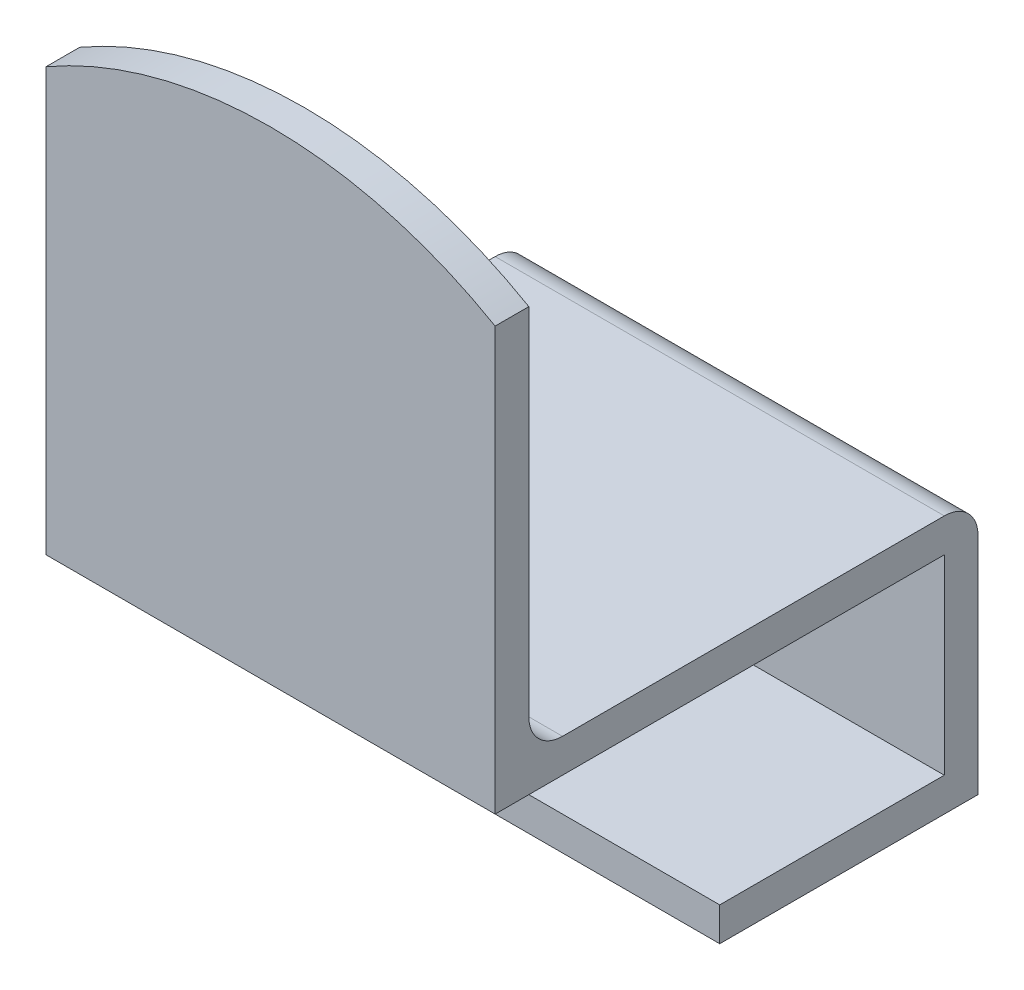
ISO-10303-21;
HEADER;
FILE_DESCRIPTION(('STEP AP214'),'2;1');
FILE_NAME('part.step','',(''),(''),'','','');
FILE_SCHEMA(('AUTOMOTIVE_DESIGN { 1 0 10303 214 1 1 1 1 }'));
ENDSEC;
DATA;
#1=APPLICATION_CONTEXT('core data for automotive mechanical design processes');
#2=APPLICATION_PROTOCOL_DEFINITION('international standard','automotive_design',2000,#1);
#3=PRODUCT_CONTEXT('',#1,'mechanical');
#4=PRODUCT('Part','Part','',(#3));
#5=PRODUCT_RELATED_PRODUCT_CATEGORY('part','',(#4));
#6=PRODUCT_DEFINITION_FORMATION('','',#4);
#7=PRODUCT_DEFINITION_CONTEXT('part definition',#1,'design');
#8=PRODUCT_DEFINITION('design','',#6,#7);
#9=PRODUCT_DEFINITION_SHAPE('','',#8);
#10=(LENGTH_UNIT() NAMED_UNIT(*) SI_UNIT(.MILLI.,.METRE.));
#11=(NAMED_UNIT(*) PLANE_ANGLE_UNIT() SI_UNIT($,.RADIAN.));
#12=(NAMED_UNIT(*) SI_UNIT($,.STERADIAN.) SOLID_ANGLE_UNIT());
#13=UNCERTAINTY_MEASURE_WITH_UNIT(LENGTH_MEASURE(1.E-05),#10,'distance_accuracy_value','');
#14=(GEOMETRIC_REPRESENTATION_CONTEXT(3) GLOBAL_UNCERTAINTY_ASSIGNED_CONTEXT((#13)) GLOBAL_UNIT_ASSIGNED_CONTEXT((#10,
#11,#12)) REPRESENTATION_CONTEXT('',''));
#15=CARTESIAN_POINT('',(0.,0.,0.));
#16=DIRECTION('',(0.,0.,1.));
#17=DIRECTION('',(1.,0.,0.));
#18=AXIS2_PLACEMENT_3D('',#15,#16,#17);
#19=CARTESIAN_POINT('',(-20.,-20.,-17.));
#20=DIRECTION('',(0.,0.,-1.));
#21=DIRECTION('',(-1.,0.,0.));
#22=AXIS2_PLACEMENT_3D('',#19,#20,#21);
#23=PLANE('',#22);
#24=DIRECTION('',(-1.,0.,0.));
#25=VECTOR('',#24,1.);
#26=CARTESIAN_POINT('',(-20.,-17.,-17.));
#27=LINE('',#26,#25);
#28=CARTESIAN_POINT('',(20.,-17.,-17.));
#29=VERTEX_POINT('',#28);
#30=CARTESIAN_POINT('',(-20.,-17.,-17.));
#31=VERTEX_POINT('',#30);
#32=EDGE_CURVE('E143',#29,#31,#27,.T.);
#33=ORIENTED_EDGE('',*,*,#32,.F.);
#34=DIRECTION('',(0.,1.,0.));
#35=VECTOR('',#34,1.);
#36=CARTESIAN_POINT('',(20.,-20.,-17.));
#37=LINE('',#36,#35);
#38=CARTESIAN_POINT('',(20.,0.,-17.));
#39=VERTEX_POINT('',#38);
#40=EDGE_CURVE('E149',#29,#39,#37,.T.);
#41=ORIENTED_EDGE('',*,*,#40,.T.);
#42=DIRECTION('',(-1.,0.,0.));
#43=VECTOR('',#42,1.);
#44=CARTESIAN_POINT('',(-20.,0.,-17.));
#45=LINE('',#44,#43);
#46=CARTESIAN_POINT('',(-20.,0.,-17.));
#47=VERTEX_POINT('',#46);
#48=EDGE_CURVE('E162',#39,#47,#45,.T.);
#49=ORIENTED_EDGE('',*,*,#48,.T.);
#50=DIRECTION('',(0.,1.,0.));
#51=VECTOR('',#50,1.);
#52=CARTESIAN_POINT('',(-20.,-20.,-17.));
#53=LINE('',#52,#51);
#54=EDGE_CURVE('E172',#31,#47,#53,.T.);
#55=ORIENTED_EDGE('',*,*,#54,.F.);
#56=EDGE_LOOP('',(#33,#41,#49,#55));
#57=FACE_BOUND('',#56,.T.);
#58=ADVANCED_FACE('F33',(#57),#23,.F.);
#59=CARTESIAN_POINT('',(-20.,3.,20.));
#60=DIRECTION('',(-1.,0.,0.));
#61=DIRECTION('',(0.,0.,1.));
#62=AXIS2_PLACEMENT_3D('',#59,#60,#61);
#63=PLANE('',#62);
#64=DIRECTION('',(0.,0.,-1.));
#65=VECTOR('',#64,1.);
#66=CARTESIAN_POINT('',(-20.,3.,20.));
#67=LINE('',#66,#65);
#68=CARTESIAN_POINT('',(-20.,3.,17.));
#69=VERTEX_POINT('',#68);
#70=CARTESIAN_POINT('',(-20.,3.,-17.));
#71=VERTEX_POINT('',#70);
#72=EDGE_CURVE('E191',#69,#71,#67,.T.);
#73=ORIENTED_EDGE('',*,*,#72,.T.);
#74=CARTESIAN_POINT('',(-20.,0.,-17.));
#75=DIRECTION('',(-1.,0.,0.));
#76=DIRECTION('',(0.,0.,1.));
#77=AXIS2_PLACEMENT_3D('',#74,#75,#76);
#78=CIRCLE('',#77,3.);
#79=CARTESIAN_POINT('',(-20.,0.,-20.));
#80=VERTEX_POINT('',#79);
#81=EDGE_CURVE('E48',#71,#80,#78,.T.);
#82=ORIENTED_EDGE('',*,*,#81,.T.);
#83=DIRECTION('',(0.,-1.,0.));
#84=VECTOR('',#83,1.);
#85=CARTESIAN_POINT('',(-20.,3.,-20.));
#86=LINE('',#85,#84);
#87=CARTESIAN_POINT('',(-20.,-20.,-20.));
#88=VERTEX_POINT('',#87);
#89=EDGE_CURVE('E197',#80,#88,#86,.T.);
#90=ORIENTED_EDGE('',*,*,#89,.T.);
#91=DIRECTION('',(0.,0.,-1.));
#92=VECTOR('',#91,1.);
#93=CARTESIAN_POINT('',(-20.,-20.,-20.));
#94=LINE('',#93,#92);
#95=CARTESIAN_POINT('',(-20.,-20.,3.));
#96=VERTEX_POINT('',#95);
#97=EDGE_CURVE('E164',#96,#88,#94,.T.);
#98=ORIENTED_EDGE('',*,*,#97,.F.);
#99=DIRECTION('',(0.,-1.,0.));
#100=VECTOR('',#99,1.);
#101=CARTESIAN_POINT('',(-20.,-20.,3.));
#102=LINE('',#101,#100);
#103=CARTESIAN_POINT('',(-20.,-17.,3.));
#104=VERTEX_POINT('',#103);
#105=EDGE_CURVE('E133',#104,#96,#102,.T.);
#106=ORIENTED_EDGE('',*,*,#105,.F.);
#107=DIRECTION('',(0.,0.,-1.));
#108=VECTOR('',#107,1.);
#109=CARTESIAN_POINT('',(-20.,-17.,3.));
#110=LINE('',#109,#108);
#111=EDGE_CURVE('E129',#104,#31,#110,.T.);
#112=ORIENTED_EDGE('',*,*,#111,.T.);
#113=ORIENTED_EDGE('',*,*,#54,.T.);
#114=DIRECTION('',(0.,0.,-1.));
#115=VECTOR('',#114,1.);
#116=CARTESIAN_POINT('',(-20.,0.,20.));
#117=LINE('',#116,#115);
#118=CARTESIAN_POINT('',(-20.,0.,23.));
#119=VERTEX_POINT('',#118);
#120=EDGE_CURVE('E190',#119,#47,#117,.T.);
#121=ORIENTED_EDGE('',*,*,#120,.F.);
#122=DIRECTION('',(0.,-1.,0.));
#123=VECTOR('',#122,1.);
#124=CARTESIAN_POINT('',(-20.,53.,23.));
#125=LINE('',#124,#123);
#126=CARTESIAN_POINT('',(-20.,37.6410161513776,23.));
#127=VERTEX_POINT('',#126);
#128=EDGE_CURVE('E182',#127,#119,#125,.T.);
#129=ORIENTED_EDGE('',*,*,#128,.F.);
#130=DIRECTION('',(0.,0.,-1.));
#131=VECTOR('',#130,1.);
#132=CARTESIAN_POINT('',(-20.,37.6410161513775,23.001));
#133=LINE('',#132,#131);
#134=CARTESIAN_POINT('',(-20.,37.6410161513775,20.));
#135=VERTEX_POINT('',#134);
#136=EDGE_CURVE('E159',#127,#135,#133,.T.);
#137=ORIENTED_EDGE('',*,*,#136,.T.);
#138=DIRECTION('',(0.,-1.,0.));
#139=VECTOR('',#138,1.);
#140=CARTESIAN_POINT('',(-20.,53.,20.));
#141=LINE('',#140,#139);
#142=CARTESIAN_POINT('',(-20.,6.,20.));
#143=VERTEX_POINT('',#142);
#144=EDGE_CURVE('E184',#135,#143,#141,.T.);
#145=ORIENTED_EDGE('',*,*,#144,.T.);
#146=CARTESIAN_POINT('',(-20.,6.,17.));
#147=DIRECTION('',(-1.,0.,0.));
#148=DIRECTION('',(0.,0.,1.));
#149=AXIS2_PLACEMENT_3D('',#146,#147,#148);
#150=CIRCLE('',#149,3.);
#151=EDGE_CURVE('E11',#143,#69,#150,.F.);
#152=ORIENTED_EDGE('',*,*,#151,.T.);
#153=EDGE_LOOP('',(#73,#82,#90,#98,#106,#112,#113,#121,#129,#137,#145,#152));
#154=FACE_BOUND('',#153,.T.);
#155=ADVANCED_FACE('F227',(#154),#63,.T.);
#156=CARTESIAN_POINT('',(20.,3.,20.));
#157=DIRECTION('',(-1.,0.,0.));
#158=DIRECTION('',(0.,0.,1.));
#159=AXIS2_PLACEMENT_3D('',#156,#157,#158);
#160=PLANE('',#159);
#161=DIRECTION('',(0.,-1.,0.));
#162=VECTOR('',#161,1.);
#163=CARTESIAN_POINT('',(20.,3.,-20.));
#164=LINE('',#163,#162);
#165=CARTESIAN_POINT('',(20.,0.,-20.));
#166=VERTEX_POINT('',#165);
#167=CARTESIAN_POINT('',(20.,-20.,-20.));
#168=VERTEX_POINT('',#167);
#169=EDGE_CURVE('E201',#166,#168,#164,.T.);
#170=ORIENTED_EDGE('',*,*,#169,.F.);
#171=CARTESIAN_POINT('',(20.,0.,-17.));
#172=DIRECTION('',(-1.,0.,0.));
#173=DIRECTION('',(0.,0.,1.));
#174=AXIS2_PLACEMENT_3D('',#171,#172,#173);
#175=CIRCLE('',#174,3.);
#176=CARTESIAN_POINT('',(20.,3.,-17.));
#177=VERTEX_POINT('',#176);
#178=EDGE_CURVE('E56',#166,#177,#175,.F.);
#179=ORIENTED_EDGE('',*,*,#178,.T.);
#180=DIRECTION('',(0.,0.,-1.));
#181=VECTOR('',#180,1.);
#182=CARTESIAN_POINT('',(20.,3.,20.));
#183=LINE('',#182,#181);
#184=CARTESIAN_POINT('',(20.,3.,17.));
#185=VERTEX_POINT('',#184);
#186=EDGE_CURVE('E193',#185,#177,#183,.T.);
#187=ORIENTED_EDGE('',*,*,#186,.F.);
#188=CARTESIAN_POINT('',(20.,6.,17.));
#189=DIRECTION('',(-1.,0.,0.));
#190=DIRECTION('',(0.,0.,1.));
#191=AXIS2_PLACEMENT_3D('',#188,#189,#190);
#192=CIRCLE('',#191,3.);
#193=CARTESIAN_POINT('',(20.,6.,20.));
#194=VERTEX_POINT('',#193);
#195=EDGE_CURVE('E41',#185,#194,#192,.T.);
#196=ORIENTED_EDGE('',*,*,#195,.T.);
#197=DIRECTION('',(0.,-1.,0.));
#198=VECTOR('',#197,1.);
#199=CARTESIAN_POINT('',(20.,53.,20.));
#200=LINE('',#199,#198);
#201=CARTESIAN_POINT('',(20.,37.6410161513775,20.));
#202=VERTEX_POINT('',#201);
#203=EDGE_CURVE('E187',#202,#194,#200,.T.);
#204=ORIENTED_EDGE('',*,*,#203,.F.);
#205=DIRECTION('',(0.,0.,-1.));
#206=VECTOR('',#205,1.);
#207=CARTESIAN_POINT('',(20.,37.6410161513775,23.001));
#208=LINE('',#207,#206);
#209=CARTESIAN_POINT('',(20.,37.6410161513775,23.));
#210=VERTEX_POINT('',#209);
#211=EDGE_CURVE('E158',#210,#202,#208,.T.);
#212=ORIENTED_EDGE('',*,*,#211,.F.);
#213=DIRECTION('',(0.,-1.,0.));
#214=VECTOR('',#213,1.);
#215=CARTESIAN_POINT('',(20.,53.,23.));
#216=LINE('',#215,#214);
#217=CARTESIAN_POINT('',(20.,0.,23.));
#218=VERTEX_POINT('',#217);
#219=EDGE_CURVE('E180',#210,#218,#216,.T.);
#220=ORIENTED_EDGE('',*,*,#219,.T.);
#221=DIRECTION('',(0.,0.,-1.));
#222=VECTOR('',#221,1.);
#223=CARTESIAN_POINT('',(20.,0.,20.));
#224=LINE('',#223,#222);
#225=EDGE_CURVE('E194',#218,#39,#224,.T.);
#226=ORIENTED_EDGE('',*,*,#225,.T.);
#227=ORIENTED_EDGE('',*,*,#40,.F.);
#228=DIRECTION('',(0.,0.,-1.));
#229=VECTOR('',#228,1.);
#230=CARTESIAN_POINT('',(20.,-17.,3.));
#231=LINE('',#230,#229);
#232=CARTESIAN_POINT('',(20.,-17.,3.));
#233=VERTEX_POINT('',#232);
#234=EDGE_CURVE('E126',#233,#29,#231,.T.);
#235=ORIENTED_EDGE('',*,*,#234,.F.);
#236=DIRECTION('',(0.,1.,0.));
#237=VECTOR('',#236,1.);
#238=CARTESIAN_POINT('',(20.,-17.,3.));
#239=LINE('',#238,#237);
#240=CARTESIAN_POINT('',(20.,-20.,3.));
#241=VERTEX_POINT('',#240);
#242=EDGE_CURVE('E134',#241,#233,#239,.T.);
#243=ORIENTED_EDGE('',*,*,#242,.F.);
#244=DIRECTION('',(0.,0.,1.));
#245=VECTOR('',#244,1.);
#246=CARTESIAN_POINT('',(20.,-20.,-20.));
#247=LINE('',#246,#245);
#248=EDGE_CURVE('E170',#168,#241,#247,.T.);
#249=ORIENTED_EDGE('',*,*,#248,.F.);
#250=EDGE_LOOP('',(#170,#179,#187,#196,#204,#212,#220,#226,#227,#235,#243,#249));
#251=FACE_BOUND('',#250,.T.);
#252=ADVANCED_FACE('F147',(#251),#160,.F.);
#253=CARTESIAN_POINT('',(-20.,3.,-20.));
#254=DIRECTION('',(0.,0.,-1.));
#255=DIRECTION('',(-1.,0.,0.));
#256=AXIS2_PLACEMENT_3D('',#253,#254,#255);
#257=PLANE('',#256);
#258=ORIENTED_EDGE('',*,*,#89,.F.);
#259=DIRECTION('',(1.,0.,0.));
#260=VECTOR('',#259,1.);
#261=CARTESIAN_POINT('',(20.,0.,-20.));
#262=LINE('',#261,#260);
#263=EDGE_CURVE('E211',#80,#166,#262,.T.);
#264=ORIENTED_EDGE('',*,*,#263,.T.);
#265=ORIENTED_EDGE('',*,*,#169,.T.);
#266=DIRECTION('',(1.,0.,0.));
#267=VECTOR('',#266,1.);
#268=CARTESIAN_POINT('',(-20.,-20.,-20.));
#269=LINE('',#268,#267);
#270=EDGE_CURVE('E167',#88,#168,#269,.T.);
#271=ORIENTED_EDGE('',*,*,#270,.F.);
#272=EDGE_LOOP('',(#258,#264,#265,#271));
#273=FACE_BOUND('',#272,.T.);
#274=ADVANCED_FACE('F231',(#273),#257,.T.);
#275=CARTESIAN_POINT('',(0.,3.,0.));
#276=DIRECTION('',(0.,-1.,0.));
#277=DIRECTION('',(0.,0.,-1.));
#278=AXIS2_PLACEMENT_3D('',#275,#276,#277);
#279=PLANE('',#278);
#280=ORIENTED_EDGE('',*,*,#72,.F.);
#281=DIRECTION('',(1.,0.,0.));
#282=VECTOR('',#281,1.);
#283=CARTESIAN_POINT('',(20.,3.,17.));
#284=LINE('',#283,#282);
#285=EDGE_CURVE('E206',#69,#185,#284,.T.);
#286=ORIENTED_EDGE('',*,*,#285,.T.);
#287=ORIENTED_EDGE('',*,*,#186,.T.);
#288=DIRECTION('',(1.,0.,0.));
#289=VECTOR('',#288,1.);
#290=CARTESIAN_POINT('',(-20.,3.,-17.));
#291=LINE('',#290,#289);
#292=EDGE_CURVE('E203',#177,#71,#291,.F.);
#293=ORIENTED_EDGE('',*,*,#292,.T.);
#294=EDGE_LOOP('',(#280,#286,#287,#293));
#295=FACE_BOUND('',#294,.T.);
#296=ADVANCED_FACE('F229',(#295),#279,.F.);
#297=CARTESIAN_POINT('',(0.,0.,0.));
#298=DIRECTION('',(0.,-1.,0.));
#299=DIRECTION('',(0.,0.,-1.));
#300=AXIS2_PLACEMENT_3D('',#297,#298,#299);
#301=PLANE('',#300);
#302=ORIENTED_EDGE('',*,*,#48,.F.);
#303=ORIENTED_EDGE('',*,*,#225,.F.);
#304=DIRECTION('',(1.,0.,0.));
#305=VECTOR('',#304,1.);
#306=CARTESIAN_POINT('',(20.,0.,23.));
#307=LINE('',#306,#305);
#308=EDGE_CURVE('E177',#119,#218,#307,.T.);
#309=ORIENTED_EDGE('',*,*,#308,.F.);
#310=ORIENTED_EDGE('',*,*,#120,.T.);
#311=EDGE_LOOP('',(#302,#303,#309,#310));
#312=FACE_BOUND('',#311,.T.);
#313=ADVANCED_FACE('F243',(#312),#301,.T.);
#314=CARTESIAN_POINT('',(20.,53.,20.));
#315=DIRECTION('',(0.,0.,1.));
#316=DIRECTION('',(1.,0.,0.));
#317=AXIS2_PLACEMENT_3D('',#314,#315,#316);
#318=PLANE('',#317);
#319=ORIENTED_EDGE('',*,*,#203,.T.);
#320=DIRECTION('',(1.,0.,0.));
#321=VECTOR('',#320,1.);
#322=CARTESIAN_POINT('',(-20.,6.,20.));
#323=LINE('',#322,#321);
#324=EDGE_CURVE('E209',#194,#143,#323,.F.);
#325=ORIENTED_EDGE('',*,*,#324,.T.);
#326=ORIENTED_EDGE('',*,*,#144,.F.);
#327=CARTESIAN_POINT('',(0.,3.,20.));
#328=DIRECTION('',(0.,0.,1.));
#329=DIRECTION('',(-1.,0.,0.));
#330=AXIS2_PLACEMENT_3D('',#327,#328,#329);
#331=CIRCLE('',#330,40.);
#332=EDGE_CURVE('E152',#202,#135,#331,.T.);
#333=ORIENTED_EDGE('',*,*,#332,.F.);
#334=EDGE_LOOP('',(#319,#325,#326,#333));
#335=FACE_BOUND('',#334,.T.);
#336=ADVANCED_FACE('F222',(#335),#318,.F.);
#337=CARTESIAN_POINT('',(20.,53.,23.));
#338=DIRECTION('',(0.,0.,-1.));
#339=DIRECTION('',(-1.,0.,0.));
#340=AXIS2_PLACEMENT_3D('',#337,#338,#339);
#341=PLANE('',#340);
#342=ORIENTED_EDGE('',*,*,#219,.F.);
#343=CARTESIAN_POINT('',(0.,3.,23.));
#344=DIRECTION('',(0.,0.,-1.));
#345=DIRECTION('',(-1.,0.,0.));
#346=AXIS2_PLACEMENT_3D('',#343,#344,#345);
#347=CIRCLE('',#346,40.);
#348=EDGE_CURVE('E150',#127,#210,#347,.T.);
#349=ORIENTED_EDGE('',*,*,#348,.F.);
#350=ORIENTED_EDGE('',*,*,#128,.T.);
#351=ORIENTED_EDGE('',*,*,#308,.T.);
#352=EDGE_LOOP('',(#342,#349,#350,#351));
#353=FACE_BOUND('',#352,.T.);
#354=ADVANCED_FACE('F248',(#353),#341,.F.);
#355=CARTESIAN_POINT('',(0.,-20.,0.));
#356=DIRECTION('',(0.,1.,0.));
#357=DIRECTION('',(0.,0.,1.));
#358=AXIS2_PLACEMENT_3D('',#355,#356,#357);
#359=PLANE('',#358);
#360=ORIENTED_EDGE('',*,*,#97,.T.);
#361=ORIENTED_EDGE('',*,*,#270,.T.);
#362=ORIENTED_EDGE('',*,*,#248,.T.);
#363=DIRECTION('',(1.,0.,0.));
#364=VECTOR('',#363,1.);
#365=CARTESIAN_POINT('',(20.,-20.,3.));
#366=LINE('',#365,#364);
#367=EDGE_CURVE('E140',#96,#241,#366,.T.);
#368=ORIENTED_EDGE('',*,*,#367,.F.);
#369=EDGE_LOOP('',(#360,#361,#362,#368));
#370=FACE_BOUND('',#369,.T.);
#371=ADVANCED_FACE('F234',(#370),#359,.F.);
#372=CARTESIAN_POINT('',(0.,3.,23.001));
#373=DIRECTION('',(0.,0.,-1.));
#374=DIRECTION('',(-1.,0.,0.));
#375=AXIS2_PLACEMENT_3D('',#372,#373,#374);
#376=CYLINDRICAL_SURFACE('',#375,40.);
#377=ORIENTED_EDGE('',*,*,#348,.T.);
#378=ORIENTED_EDGE('',*,*,#211,.T.);
#379=ORIENTED_EDGE('',*,*,#332,.T.);
#380=ORIENTED_EDGE('',*,*,#136,.F.);
#381=EDGE_LOOP('',(#377,#378,#379,#380));
#382=FACE_BOUND('',#381,.T.);
#383=ADVANCED_FACE('F251',(#382),#376,.T.);
#384=CARTESIAN_POINT('',(0.,6.,17.));
#385=DIRECTION('',(-1.,0.,0.));
#386=DIRECTION('',(0.,0.,1.));
#387=AXIS2_PLACEMENT_3D('',#384,#385,#386);
#388=CYLINDRICAL_SURFACE('',#387,3.);
#389=ORIENTED_EDGE('',*,*,#151,.F.);
#390=ORIENTED_EDGE('',*,*,#324,.F.);
#391=ORIENTED_EDGE('',*,*,#195,.F.);
#392=ORIENTED_EDGE('',*,*,#285,.F.);
#393=EDGE_LOOP('',(#389,#390,#391,#392));
#394=FACE_BOUND('',#393,.T.);
#395=ADVANCED_FACE('F225',(#394),#388,.F.);
#396=CARTESIAN_POINT('',(-20.,0.,-17.));
#397=DIRECTION('',(-1.,0.,0.));
#398=DIRECTION('',(0.,0.,1.));
#399=AXIS2_PLACEMENT_3D('',#396,#397,#398);
#400=CYLINDRICAL_SURFACE('',#399,3.);
#401=ORIENTED_EDGE('',*,*,#81,.F.);
#402=ORIENTED_EDGE('',*,*,#292,.F.);
#403=ORIENTED_EDGE('',*,*,#178,.F.);
#404=ORIENTED_EDGE('',*,*,#263,.F.);
#405=EDGE_LOOP('',(#401,#402,#403,#404));
#406=FACE_BOUND('',#405,.T.);
#407=ADVANCED_FACE('F35',(#406),#400,.T.);
#408=CARTESIAN_POINT('',(-20.,-17.,3.));
#409=DIRECTION('',(0.,-1.,0.));
#410=DIRECTION('',(0.,0.,-1.));
#411=AXIS2_PLACEMENT_3D('',#408,#409,#410);
#412=PLANE('',#411);
#413=ORIENTED_EDGE('',*,*,#32,.T.);
#414=ORIENTED_EDGE('',*,*,#111,.F.);
#415=DIRECTION('',(-1.,0.,0.));
#416=VECTOR('',#415,1.);
#417=CARTESIAN_POINT('',(-20.,-17.,3.));
#418=LINE('',#417,#416);
#419=EDGE_CURVE('E122',#233,#104,#418,.T.);
#420=ORIENTED_EDGE('',*,*,#419,.F.);
#421=ORIENTED_EDGE('',*,*,#234,.T.);
#422=EDGE_LOOP('',(#413,#414,#420,#421));
#423=FACE_BOUND('',#422,.T.);
#424=ADVANCED_FACE('F124',(#423),#412,.F.);
#425=CARTESIAN_POINT('',(0.,0.,3.));
#426=DIRECTION('',(0.,0.,-1.));
#427=DIRECTION('',(-1.,0.,0.));
#428=AXIS2_PLACEMENT_3D('',#425,#426,#427);
#429=PLANE('',#428);
#430=ORIENTED_EDGE('',*,*,#242,.T.);
#431=ORIENTED_EDGE('',*,*,#419,.T.);
#432=ORIENTED_EDGE('',*,*,#105,.T.);
#433=ORIENTED_EDGE('',*,*,#367,.T.);
#434=EDGE_LOOP('',(#430,#431,#432,#433));
#435=FACE_BOUND('',#434,.T.);
#436=ADVANCED_FACE('F138',(#435),#429,.F.);
#437=CLOSED_SHELL('',(#58,#155,#252,#274,#296,#313,#336,#354,#371,#383,#395,#407,#424,#436));
#438=MANIFOLD_SOLID_BREP('B2',#437);
#439=ADVANCED_BREP_SHAPE_REPRESENTATION('',(#18,#438),#14);
#440=SHAPE_DEFINITION_REPRESENTATION(#9,#439);
ENDSEC;
END-ISO-10303-21;
